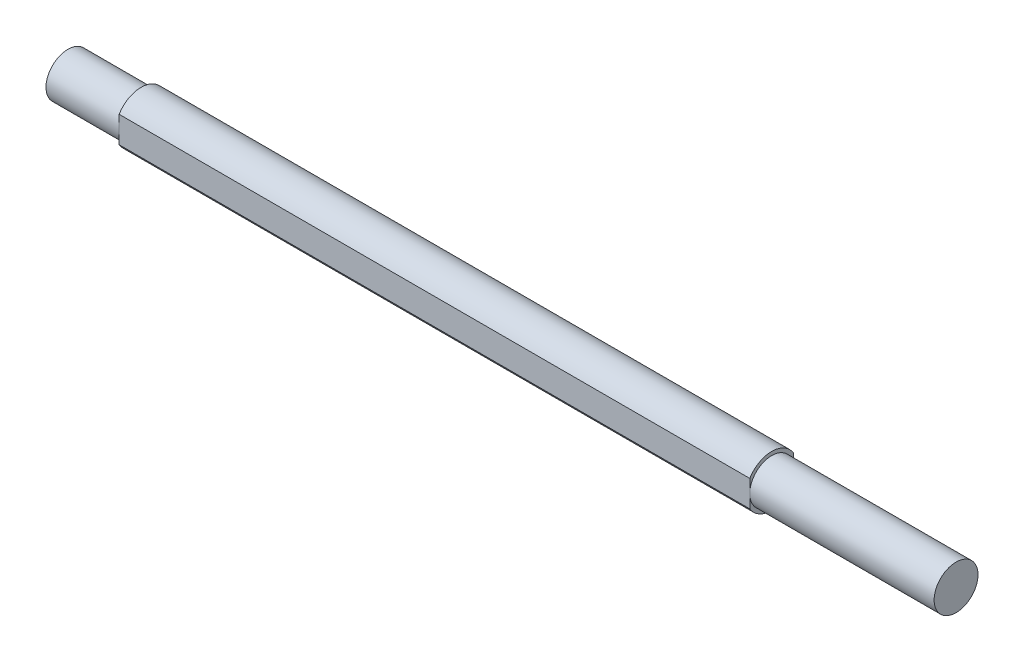
ISO-10303-21;
HEADER;
FILE_DESCRIPTION(('STEP AP214'),'2;1');
FILE_NAME('part.step','',(''),(''),'','','');
FILE_SCHEMA(('AUTOMOTIVE_DESIGN { 1 0 10303 214 1 1 1 1 }'));
ENDSEC;
DATA;
#1=APPLICATION_CONTEXT('core data for automotive mechanical design processes');
#2=APPLICATION_PROTOCOL_DEFINITION('international standard','automotive_design',2000,#1);
#3=PRODUCT_CONTEXT('',#1,'mechanical');
#4=PRODUCT('Part','Part','',(#3));
#5=PRODUCT_RELATED_PRODUCT_CATEGORY('part','',(#4));
#6=PRODUCT_DEFINITION_FORMATION('','',#4);
#7=PRODUCT_DEFINITION_CONTEXT('part definition',#1,'design');
#8=PRODUCT_DEFINITION('design','',#6,#7);
#9=PRODUCT_DEFINITION_SHAPE('','',#8);
#10=(LENGTH_UNIT() NAMED_UNIT(*) SI_UNIT(.MILLI.,.METRE.));
#11=(NAMED_UNIT(*) PLANE_ANGLE_UNIT() SI_UNIT($,.RADIAN.));
#12=(NAMED_UNIT(*) SI_UNIT($,.STERADIAN.) SOLID_ANGLE_UNIT());
#13=UNCERTAINTY_MEASURE_WITH_UNIT(LENGTH_MEASURE(1.E-05),#10,'distance_accuracy_value','');
#14=(GEOMETRIC_REPRESENTATION_CONTEXT(3) GLOBAL_UNCERTAINTY_ASSIGNED_CONTEXT((#13)) GLOBAL_UNIT_ASSIGNED_CONTEXT((#10,
#11,#12)) REPRESENTATION_CONTEXT('',''));
#15=CARTESIAN_POINT('',(0.,0.,0.));
#16=DIRECTION('',(0.,0.,1.));
#17=DIRECTION('',(1.,0.,0.));
#18=AXIS2_PLACEMENT_3D('',#15,#16,#17);
#19=CARTESIAN_POINT('',(177.5,17.5,0.));
#20=DIRECTION('',(-1.,0.,0.));
#21=DIRECTION('',(0.,-1.,0.));
#22=AXIS2_PLACEMENT_3D('',#19,#20,#21);
#23=PLANE('',#22);
#24=CARTESIAN_POINT('',(177.5,-3.68808087731798E-13,0.));
#25=DIRECTION('',(-1.,0.,0.));
#26=DIRECTION('',(0.,-1.,0.));
#27=AXIS2_PLACEMENT_3D('',#24,#25,#26);
#28=CIRCLE('',#27,17.5000000000003);
#29=CARTESIAN_POINT('',(177.5,-9.01387818866019,-15.0000000000003));
#30=VERTEX_POINT('',#29);
#31=CARTESIAN_POINT('',(177.5,-9.01387818866019,15.0000000000003));
#32=VERTEX_POINT('',#31);
#33=EDGE_CURVE('E177',#30,#32,#28,.T.);
#34=ORIENTED_EDGE('',*,*,#33,.F.);
#35=DIRECTION('',(0.,-1.,0.));
#36=VECTOR('',#35,1.);
#37=CARTESIAN_POINT('',(177.5,9.01387818866015,-15.0000000000003));
#38=LINE('',#37,#36);
#39=CARTESIAN_POINT('',(177.5,-3.6949610038306E-13,-15.0000000000003));
#40=VERTEX_POINT('',#39);
#41=EDGE_CURVE('E152',#40,#30,#38,.T.);
#42=ORIENTED_EDGE('',*,*,#41,.F.);
#43=CARTESIAN_POINT('',(177.5,-3.68808087731798E-13,0.));
#44=DIRECTION('',(-1.,0.,0.));
#45=DIRECTION('',(0.,-1.,0.));
#46=AXIS2_PLACEMENT_3D('',#43,#44,#45);
#47=CIRCLE('',#46,15.0000000000004);
#48=CARTESIAN_POINT('',(177.5,-3.6949610038306E-13,15.0000000000003));
#49=VERTEX_POINT('',#48);
#50=EDGE_CURVE('E185',#40,#49,#47,.T.);
#51=ORIENTED_EDGE('',*,*,#50,.T.);
#52=DIRECTION('',(0.,1.,0.));
#53=VECTOR('',#52,1.);
#54=CARTESIAN_POINT('',(177.5,9.01387818866015,15.0000000000003));
#55=LINE('',#54,#53);
#56=EDGE_CURVE('E165',#32,#49,#55,.T.);
#57=ORIENTED_EDGE('',*,*,#56,.F.);
#58=EDGE_LOOP('',(#34,#42,#51,#57));
#59=FACE_BOUND('',#58,.T.);
#60=ADVANCED_FACE('F34',(#59),#23,.F.);
#61=CARTESIAN_POINT('',(-303.5,-4.00105338657338E-13,0.));
#62=DIRECTION('',(-1.,0.,0.));
#63=DIRECTION('',(0.,-1.,0.));
#64=AXIS2_PLACEMENT_3D('',#61,#62,#63);
#65=CYLINDRICAL_SURFACE('',#64,17.5000000000004);
#66=CARTESIAN_POINT('',(177.5,9.01387818866015,15.0000000000003));
#67=VERTEX_POINT('',#66);
#68=CARTESIAN_POINT('',(177.5,9.01387818866015,-15.0000000000003));
#69=VERTEX_POINT('',#68);
#70=EDGE_CURVE('E180',#67,#69,#28,.T.);
#71=ORIENTED_EDGE('',*,*,#70,.T.);
#72=DIRECTION('',(-1.,0.,0.));
#73=VECTOR('',#72,1.);
#74=CARTESIAN_POINT('',(195.700274723202,9.01387818866015,-15.0000000000003));
#75=LINE('',#74,#73);
#76=CARTESIAN_POINT('',(-253.5,9.01387818866015,-15.0000000000003));
#77=VERTEX_POINT('',#76);
#78=EDGE_CURVE('E149',#69,#77,#75,.T.);
#79=ORIENTED_EDGE('',*,*,#78,.T.);
#80=CARTESIAN_POINT('',(-253.5,-3.96851986170275E-13,0.));
#81=DIRECTION('',(-1.,0.,0.));
#82=DIRECTION('',(0.,-1.,0.));
#83=AXIS2_PLACEMENT_3D('',#80,#81,#82);
#84=CIRCLE('',#83,17.5000000000004);
#85=CARTESIAN_POINT('',(-253.5,9.01387818865997,15.0000000000003));
#86=VERTEX_POINT('',#85);
#87=EDGE_CURVE('E176',#86,#77,#84,.T.);
#88=ORIENTED_EDGE('',*,*,#87,.F.);
#89=DIRECTION('',(-1.,0.,0.));
#90=VECTOR('',#89,1.);
#91=CARTESIAN_POINT('',(195.700274723202,9.01387818866015,15.0000000000003));
#92=LINE('',#91,#90);
#93=EDGE_CURVE('E159',#67,#86,#92,.T.);
#94=ORIENTED_EDGE('',*,*,#93,.F.);
#95=EDGE_LOOP('',(#71,#79,#88,#94));
#96=FACE_BOUND('',#95,.T.);
#97=ADVANCED_FACE('F235',(#96),#65,.T.);
#98=CARTESIAN_POINT('',(-253.5,15.0000000000001,0.));
#99=DIRECTION('',(1.,0.,0.));
#100=DIRECTION('',(0.,1.,0.));
#101=AXIS2_PLACEMENT_3D('',#98,#99,#100);
#102=PLANE('',#101);
#103=ORIENTED_EDGE('',*,*,#87,.T.);
#104=DIRECTION('',(0.,1.,0.));
#105=VECTOR('',#104,1.);
#106=CARTESIAN_POINT('',(-253.5,9.01387818866015,-15.0000000000003));
#107=LINE('',#106,#105);
#108=CARTESIAN_POINT('',(-253.5,-3.96851986170275E-13,-15.0000000000003));
#109=VERTEX_POINT('',#108);
#110=EDGE_CURVE('E148',#109,#77,#107,.T.);
#111=ORIENTED_EDGE('',*,*,#110,.F.);
#112=CARTESIAN_POINT('',(-253.5,-3.96851986170275E-13,0.));
#113=DIRECTION('',(-1.,0.,0.));
#114=DIRECTION('',(0.,-1.,0.));
#115=AXIS2_PLACEMENT_3D('',#112,#113,#114);
#116=CIRCLE('',#115,15.0000000000005);
#117=CARTESIAN_POINT('',(-253.5,-3.96851986170275E-13,15.0000000000003));
#118=VERTEX_POINT('',#117);
#119=EDGE_CURVE('E170',#118,#109,#116,.T.);
#120=ORIENTED_EDGE('',*,*,#119,.F.);
#121=DIRECTION('',(0.,-1.,0.));
#122=VECTOR('',#121,1.);
#123=CARTESIAN_POINT('',(-253.5,9.01387818866015,15.0000000000003));
#124=LINE('',#123,#122);
#125=EDGE_CURVE('E157',#86,#118,#124,.T.);
#126=ORIENTED_EDGE('',*,*,#125,.F.);
#127=EDGE_LOOP('',(#103,#111,#120,#126));
#128=FACE_BOUND('',#127,.T.);
#129=ADVANCED_FACE('F231',(#128),#102,.F.);
#130=CARTESIAN_POINT('',(303.5,15.0000000000001,0.));
#131=DIRECTION('',(-1.,0.,0.));
#132=DIRECTION('',(0.,-1.,0.));
#133=AXIS2_PLACEMENT_3D('',#130,#131,#132);
#134=PLANE('',#133);
#135=CARTESIAN_POINT('',(303.5,-3.60609639464401E-13,0.));
#136=DIRECTION('',(-1.,0.,0.));
#137=DIRECTION('',(0.,-1.,0.));
#138=AXIS2_PLACEMENT_3D('',#135,#136,#137);
#139=CIRCLE('',#138,15.0000000000005);
#140=CARTESIAN_POINT('',(303.5,-15.0000000000008,0.));
#141=VERTEX_POINT('',#140);
#142=EDGE_CURVE('E184',#141,#141,#139,.T.);
#143=ORIENTED_EDGE('',*,*,#142,.F.);
#144=EDGE_LOOP('',(#143));
#145=FACE_BOUND('',#144,.T.);
#146=ADVANCED_FACE('F36',(#145),#134,.F.);
#147=CARTESIAN_POINT('',(-303.5,-4.00105338657338E-13,0.));
#148=DIRECTION('',(-1.,0.,0.));
#149=DIRECTION('',(0.,-1.,0.));
#150=AXIS2_PLACEMENT_3D('',#147,#148,#149);
#151=CYLINDRICAL_SURFACE('',#150,15.0000000000004);
#152=DIRECTION('',(-1.,0.,0.));
#153=VECTOR('',#152,1.);
#154=CARTESIAN_POINT('',(-303.5,-14.4568322948018,4.00000000000006));
#155=LINE('',#154,#153);
#156=CARTESIAN_POINT('',(237.5,-14.4568322948018,4.00000000000001));
#157=VERTEX_POINT('',#156);
#158=CARTESIAN_POINT('',(297.5,-14.4568322948018,4.));
#159=VERTEX_POINT('',#158);
#160=EDGE_CURVE('E47',#157,#159,#155,.F.);
#161=ORIENTED_EDGE('',*,*,#160,.T.);
#162=CARTESIAN_POINT('',(297.5,-14.4568322948018,4.));
#163=CARTESIAN_POINT('',(297.610358243404,-14.4568189842475,4.00001309389174));
#164=CARTESIAN_POINT('',(297.720708521993,-14.4580956467725,3.99543311151603));
#165=CARTESIAN_POINT('',(297.940578653966,-14.4631301353525,3.97718874589725));
#166=CARTESIAN_POINT('',(298.05009865776,-14.4668875005967,3.96352604983924));
#167=CARTESIAN_POINT('',(298.267301653514,-14.4767740441066,3.92725695741262));
#168=CARTESIAN_POINT('',(298.374988087848,-14.4828981072588,3.90466984692446));
#169=CARTESIAN_POINT('',(298.587974860356,-14.4973231400475,3.85076543838184));
#170=CARTESIAN_POINT('',(298.693275156585,-14.5056241479182,3.81944798699437));
#171=CARTESIAN_POINT('',(299.004463418775,-14.5334412456835,3.71275643853687));
#172=CARTESIAN_POINT('',(299.205874933547,-14.555882959826,3.62460332607936));
#173=CARTESIAN_POINT('',(299.591020759626,-14.6060171290385,3.41695780475822));
#174=CARTESIAN_POINT('',(299.774749203972,-14.6337113178043,3.29745504324307));
#175=CARTESIAN_POINT('',(300.123970576928,-14.6920016406374,3.02730320878008));
#176=CARTESIAN_POINT('',(300.288961840966,-14.722648945245,2.87601544465616));
#177=CARTESIAN_POINT('',(300.591557566962,-14.7829523618636,2.54795832924026));
#178=CARTESIAN_POINT('',(300.729157582868,-14.8126083123125,2.37118484921246));
#179=CARTESIAN_POINT('',(300.975172130186,-14.8681604116929,1.99367199592154));
#180=CARTESIAN_POINT('',(301.083083965578,-14.8939887414065,1.79259414843393));
#181=CARTESIAN_POINT('',(301.263372888961,-14.9383834129144,1.37435575552788));
#182=CARTESIAN_POINT('',(301.335757644777,-14.9569513215526,1.15719869214845));
#183=CARTESIAN_POINT('',(301.441309825169,-14.984370921786,0.718234307369671));
#184=CARTESIAN_POINT('',(301.475337212894,-14.9934353394145,0.496647293428104));
#185=CARTESIAN_POINT('',(301.505914313223,-15.001570510364,0.050731991760574));
#186=CARTESIAN_POINT('',(301.502469484192,-15.0006427191934,-0.173595891963458));
#187=CARTESIAN_POINT('',(301.458804313632,-14.9890534931384,-0.61262950264217));
#188=CARTESIAN_POINT('',(301.419513872344,-14.9786381919451,-0.827435206418321));
#189=CARTESIAN_POINT('',(301.306774849137,-14.949534779592,-1.24728467665105));
#190=CARTESIAN_POINT('',(301.233324647849,-14.9308462762372,-1.45232797980576));
#191=CARTESIAN_POINT('',(301.053640033747,-14.8869312076953,-1.84920963545356));
#192=CARTESIAN_POINT('',(300.94708662777,-14.8616414267941,-2.04089626466618));
#193=CARTESIAN_POINT('',(300.704457231035,-14.8072486052905,-2.40398441957149));
#194=CARTESIAN_POINT('',(300.568376077817,-14.7781448982361,-2.57538239000351));
#195=CARTESIAN_POINT('',(300.265672028899,-14.7182294237981,-2.89854935036782));
#196=CARTESIAN_POINT('',(300.098241992106,-14.6873926412651,-3.0495572240081));
#197=CARTESIAN_POINT('',(299.739957159291,-14.628271620726,-3.32161448391784));
#198=CARTESIAN_POINT('',(299.549095903519,-14.5999880903717,-3.4426555807802));
#199=CARTESIAN_POINT('',(299.248646716635,-14.5618587427779,-3.59932937334134));
#200=CARTESIAN_POINT('',(299.145711084959,-14.5498268172629,-3.64754371945349));
#201=CARTESIAN_POINT('',(298.935953678728,-14.5275984074133,-3.73509417643329));
#202=CARTESIAN_POINT('',(298.829133487537,-14.5174011851065,-3.77443385857866));
#203=CARTESIAN_POINT('',(298.61248058078,-14.4991713081519,-3.84386783810503));
#204=CARTESIAN_POINT('',(298.502651121807,-14.491136408062,-3.87397173088606));
#205=CARTESIAN_POINT('',(298.280724778875,-14.4774747012199,-3.92471856960776));
#206=CARTESIAN_POINT('',(298.16862897718,-14.4718467722239,-3.94536592495321));
#207=CARTESIAN_POINT('',(297.963748975282,-14.4639761334317,-3.97411378733402));
#208=CARTESIAN_POINT('',(297.871203553833,-14.4613012625141,-3.98382319960776));
#209=CARTESIAN_POINT('',(297.68577464669,-14.4577275048604,-3.99676420153355));
#210=CARTESIAN_POINT('',(297.592891929568,-14.4568258092267,-4.00000603663184));
#211=CARTESIAN_POINT('',(297.5,-14.4568322948018,-4.));
#212=B_SPLINE_CURVE_WITH_KNOTS('',3,(#162,#163,#164,#165,#166,#167,#168,#169,#170,#171,#172,
#173,#174,#175,#176,#177,#178,#179,#180,#181,#182,#183,#184,#185,#186,#187,#188,#189,#190,#191,
#192,#193,#194,#195,#196,#197,#198,#199,#200,#201,#202,#203,#204,#205,#206,#207,#208,#209,#210,
#211),.UNSPECIFIED.,.F.,.F.,(4,2,2,2,2,2,2,2,2,2,2,2,2,2,2,2,2,2,2,2,2,2,2,2,4),(0.,
0.330958670878051,0.66185588076851,0.992041890688623,1.32223370010826,1.98190700187175,
2.64179842357632,3.31649637536153,3.99130375261123,4.67691814590527,5.36238449759352,
6.03215661862344,6.7018311790669,7.35461236515045,8.0074244999636,8.66673340793705,
9.32615767867958,10.0057598785669,10.6855498604333,11.0281077435251,11.3705275300853,
11.7125903499582,12.0544935096115,12.3335333037377,12.6121307120355),.UNSPECIFIED.);
#213=CARTESIAN_POINT('',(297.5,-14.4568322948018,-4.));
#214=VERTEX_POINT('',#213);
#215=EDGE_CURVE('E11',#159,#214,#212,.T.);
#216=ORIENTED_EDGE('',*,*,#215,.T.);
#217=DIRECTION('',(-1.,0.,0.));
#218=VECTOR('',#217,1.);
#219=CARTESIAN_POINT('',(-303.5,-14.4568322948018,-3.99999999999992));
#220=LINE('',#219,#218);
#221=CARTESIAN_POINT('',(237.5,-14.4568322948018,-3.99999999999992));
#222=VERTEX_POINT('',#221);
#223=EDGE_CURVE('E119',#214,#222,#220,.T.);
#224=ORIENTED_EDGE('',*,*,#223,.T.);
#225=CARTESIAN_POINT('',(237.5,-14.4568322948018,-3.99999999999999));
#226=CARTESIAN_POINT('',(237.389641756596,-14.4568189842475,-4.00001309389173));
#227=CARTESIAN_POINT('',(237.279291478007,-14.4580956467725,-3.99543311151602));
#228=CARTESIAN_POINT('',(237.059421346034,-14.4631301353525,-3.97718874589724));
#229=CARTESIAN_POINT('',(236.94990134224,-14.4668875005967,-3.96352604983923));
#230=CARTESIAN_POINT('',(236.732698346486,-14.4767740441067,-3.92725695741262));
#231=CARTESIAN_POINT('',(236.625011912152,-14.4828981072588,-3.90466984692445));
#232=CARTESIAN_POINT('',(236.412025139644,-14.4973231400475,-3.85076543838183));
#233=CARTESIAN_POINT('',(236.306724843415,-14.5056241479182,-3.81944798699436));
#234=CARTESIAN_POINT('',(235.995536581225,-14.5334412456835,-3.71275643853685));
#235=CARTESIAN_POINT('',(235.794125066453,-14.555882959826,-3.62460332607934));
#236=CARTESIAN_POINT('',(235.408979240374,-14.6060171290385,-3.41695780475818));
#237=CARTESIAN_POINT('',(235.225250796028,-14.6337113178043,-3.29745504324305));
#238=CARTESIAN_POINT('',(234.876029423072,-14.6920016406374,-3.02730320878009));
#239=CARTESIAN_POINT('',(234.711038159034,-14.722648945245,-2.87601544465618));
#240=CARTESIAN_POINT('',(234.408442433038,-14.7829523618636,-2.54795832924028));
#241=CARTESIAN_POINT('',(234.270842417132,-14.8126083123125,-2.37118484921248));
#242=CARTESIAN_POINT('',(234.024827869815,-14.8681604116929,-1.99367199592155));
#243=CARTESIAN_POINT('',(233.916916034422,-14.8939887414065,-1.79259414843395));
#244=CARTESIAN_POINT('',(233.736627111039,-14.9383834129144,-1.37435575552789));
#245=CARTESIAN_POINT('',(233.664242355223,-14.9569513215526,-1.15719869214844));
#246=CARTESIAN_POINT('',(233.558690174831,-14.984370921786,-0.718234307369647));
#247=CARTESIAN_POINT('',(233.524662787106,-14.9934353394145,-0.496647293428083));
#248=CARTESIAN_POINT('',(233.494085686777,-15.001570510364,-0.050731991760559));
#249=CARTESIAN_POINT('',(233.497530515807,-15.0006427191934,0.173595891963471));
#250=CARTESIAN_POINT('',(233.541195686368,-14.9890534931384,0.612629502642185));
#251=CARTESIAN_POINT('',(233.580486127656,-14.9786381919451,0.827435206418341));
#252=CARTESIAN_POINT('',(233.693225150863,-14.949534779592,1.24728467665107));
#253=CARTESIAN_POINT('',(233.766675352151,-14.9308462762372,1.45232797980577));
#254=CARTESIAN_POINT('',(233.946359966253,-14.8869312076953,1.84920963545357));
#255=CARTESIAN_POINT('',(234.05291337223,-14.8616414267941,2.04089626466619));
#256=CARTESIAN_POINT('',(234.295542768965,-14.8072486052905,2.40398441957151));
#257=CARTESIAN_POINT('',(234.431623922183,-14.7781448982361,2.57538239000353));
#258=CARTESIAN_POINT('',(234.734327971101,-14.7182294237981,2.89854935036783));
#259=CARTESIAN_POINT('',(234.901758007894,-14.6873926412652,3.0495572240081));
#260=CARTESIAN_POINT('',(235.260042840709,-14.628271620726,3.32161448391784));
#261=CARTESIAN_POINT('',(235.450904096481,-14.5999880903717,3.44265558078022));
#262=CARTESIAN_POINT('',(235.751353283365,-14.5618587427779,3.59932937334135));
#263=CARTESIAN_POINT('',(235.854288915041,-14.5498268172629,3.6475437194535));
#264=CARTESIAN_POINT('',(236.064046321271,-14.5275984074133,3.73509417643329));
#265=CARTESIAN_POINT('',(236.170866512463,-14.5174011851065,3.77443385857866));
#266=CARTESIAN_POINT('',(236.38751941922,-14.4991713081519,3.84386783810502));
#267=CARTESIAN_POINT('',(236.497348878193,-14.491136408062,3.87397173088605));
#268=CARTESIAN_POINT('',(236.719275221125,-14.4774747012199,3.92471856960776));
#269=CARTESIAN_POINT('',(236.83137102282,-14.4718467722239,3.94536592495321));
#270=CARTESIAN_POINT('',(237.036251024718,-14.4639761334317,3.97411378733404));
#271=CARTESIAN_POINT('',(237.128796446167,-14.4613012625141,3.98382319960777));
#272=CARTESIAN_POINT('',(237.31422535331,-14.4577275048604,3.99676420153356));
#273=CARTESIAN_POINT('',(237.407108070432,-14.4568258092267,4.00000603663184));
#274=CARTESIAN_POINT('',(237.5,-14.4568322948018,4.00000000000001));
#275=B_SPLINE_CURVE_WITH_KNOTS('',3,(#225,#226,#227,#228,#229,#230,#231,#232,#233,#234,#235,
#236,#237,#238,#239,#240,#241,#242,#243,#244,#245,#246,#247,#248,#249,#250,#251,#252,#253,#254,
#255,#256,#257,#258,#259,#260,#261,#262,#263,#264,#265,#266,#267,#268,#269,#270,#271,#272,#273,
#274),.UNSPECIFIED.,.F.,.F.,(4,2,2,2,2,2,2,2,2,2,2,2,2,2,2,2,2,2,2,2,2,2,2,2,4),(0.,
0.330958670878051,0.66185588076851,0.992041890688596,1.32223370010826,1.98190700187181,
2.64179842357632,3.31649637536148,3.99130375261119,4.67691814590524,5.36238449759353,
6.03215661862344,6.7018311790669,7.35461236515046,8.00742449996359,8.66673340793706,
9.32615767867958,10.005759878567,10.6855498604333,11.0281077435251,11.3705275300853,
11.7125903499582,12.0544935096114,12.3335333037377,12.6121307120356),.UNSPECIFIED.);
#276=EDGE_CURVE('E189',#222,#157,#275,.T.);
#277=ORIENTED_EDGE('',*,*,#276,.T.);
#278=EDGE_LOOP('',(#161,#216,#224,#277));
#279=FACE_BOUND('',#278,.T.);
#280=EDGE_CURVE('E181',#49,#40,#47,.T.);
#281=ORIENTED_EDGE('',*,*,#280,.F.);
#282=ORIENTED_EDGE('',*,*,#50,.F.);
#283=EDGE_LOOP('',(#281,#282));
#284=FACE_BOUND('',#283,.T.);
#285=ORIENTED_EDGE('',*,*,#142,.T.);
#286=EDGE_LOOP('',(#285));
#287=FACE_BOUND('',#286,.T.);
#288=ADVANCED_FACE('F196',(#279,#284,#287),#151,.T.);
#289=ORIENTED_EDGE('',*,*,#280,.T.);
#290=EDGE_CURVE('E154',#69,#40,#38,.T.);
#291=ORIENTED_EDGE('',*,*,#290,.F.);
#292=ORIENTED_EDGE('',*,*,#70,.F.);
#293=EDGE_CURVE('E163',#49,#67,#55,.T.);
#294=ORIENTED_EDGE('',*,*,#293,.F.);
#295=EDGE_LOOP('',(#289,#291,#292,#294));
#296=FACE_BOUND('',#295,.T.);
#297=ADVANCED_FACE('F233',(#296),#23,.F.);
#298=CARTESIAN_POINT('',(-253.5,-9.01387818866077,-15.0000000000003));
#299=VERTEX_POINT('',#298);
#300=CARTESIAN_POINT('',(-253.5,-9.01387818866019,15.0000000000003));
#301=VERTEX_POINT('',#300);
#302=EDGE_CURVE('E173',#299,#301,#84,.T.);
#303=ORIENTED_EDGE('',*,*,#302,.F.);
#304=DIRECTION('',(-1.,0.,0.));
#305=VECTOR('',#304,1.);
#306=CARTESIAN_POINT('',(195.700274723202,-9.01387818866019,-15.0000000000003));
#307=LINE('',#306,#305);
#308=EDGE_CURVE('E62',#30,#299,#307,.T.);
#309=ORIENTED_EDGE('',*,*,#308,.F.);
#310=ORIENTED_EDGE('',*,*,#33,.T.);
#311=DIRECTION('',(-1.,0.,0.));
#312=VECTOR('',#311,1.);
#313=CARTESIAN_POINT('',(195.700274723202,-9.01387818866019,15.0000000000003));
#314=LINE('',#313,#312);
#315=EDGE_CURVE('E160',#32,#301,#314,.T.);
#316=ORIENTED_EDGE('',*,*,#315,.T.);
#317=EDGE_LOOP('',(#303,#309,#310,#316));
#318=FACE_BOUND('',#317,.T.);
#319=ADVANCED_FACE('F229',(#318),#65,.T.);
#320=EDGE_CURVE('E169',#109,#118,#116,.T.);
#321=ORIENTED_EDGE('',*,*,#320,.F.);
#322=EDGE_CURVE('E146',#299,#109,#107,.T.);
#323=ORIENTED_EDGE('',*,*,#322,.F.);
#324=ORIENTED_EDGE('',*,*,#302,.T.);
#325=EDGE_CURVE('E142',#118,#301,#124,.T.);
#326=ORIENTED_EDGE('',*,*,#325,.F.);
#327=EDGE_LOOP('',(#321,#323,#324,#326));
#328=FACE_BOUND('',#327,.T.);
#329=ADVANCED_FACE('F225',(#328),#102,.F.);
#330=CARTESIAN_POINT('',(-303.5,-4.00105338657338E-13,0.));
#331=DIRECTION('',(-1.,0.,0.));
#332=DIRECTION('',(0.,-1.,0.));
#333=AXIS2_PLACEMENT_3D('',#330,#331,#332);
#334=CYLINDRICAL_SURFACE('',#333,15.0000000000005);
#335=CARTESIAN_POINT('',(-303.5,-4.00105338657338E-13,0.));
#336=DIRECTION('',(-1.,0.,0.));
#337=DIRECTION('',(0.,-1.,0.));
#338=AXIS2_PLACEMENT_3D('',#335,#336,#337);
#339=CIRCLE('',#338,15.0000000000005);
#340=CARTESIAN_POINT('',(-303.5,-15.0000000000009,0.));
#341=VERTEX_POINT('',#340);
#342=EDGE_CURVE('E156',#341,#341,#339,.T.);
#343=ORIENTED_EDGE('',*,*,#342,.F.);
#344=EDGE_LOOP('',(#343));
#345=FACE_BOUND('',#344,.T.);
#346=ORIENTED_EDGE('',*,*,#119,.T.);
#347=ORIENTED_EDGE('',*,*,#320,.T.);
#348=EDGE_LOOP('',(#346,#347));
#349=FACE_BOUND('',#348,.T.);
#350=ADVANCED_FACE('F221',(#345,#349),#334,.T.);
#351=CARTESIAN_POINT('',(-303.5,-4.00105338657338E-13,0.));
#352=DIRECTION('',(1.,0.,0.));
#353=DIRECTION('',(0.,1.,0.));
#354=AXIS2_PLACEMENT_3D('',#351,#352,#353);
#355=PLANE('',#354);
#356=ORIENTED_EDGE('',*,*,#342,.T.);
#357=EDGE_LOOP('',(#356));
#358=FACE_BOUND('',#357,.T.);
#359=ADVANCED_FACE('F217',(#358),#355,.F.);
#360=CARTESIAN_POINT('',(195.700274723202,9.01387818866015,15.0000000000003));
#361=DIRECTION('',(0.,0.,-1.));
#362=DIRECTION('',(-1.,0.,0.));
#363=AXIS2_PLACEMENT_3D('',#360,#361,#362);
#364=PLANE('',#363);
#365=ORIENTED_EDGE('',*,*,#56,.T.);
#366=ORIENTED_EDGE('',*,*,#293,.T.);
#367=ORIENTED_EDGE('',*,*,#93,.T.);
#368=ORIENTED_EDGE('',*,*,#125,.T.);
#369=ORIENTED_EDGE('',*,*,#325,.T.);
#370=ORIENTED_EDGE('',*,*,#315,.F.);
#371=EDGE_LOOP('',(#365,#366,#367,#368,#369,#370));
#372=FACE_BOUND('',#371,.T.);
#373=ADVANCED_FACE('F214',(#372),#364,.F.);
#374=CARTESIAN_POINT('',(195.700274723202,9.01387818866015,-15.0000000000003));
#375=DIRECTION('',(0.,0.,1.));
#376=DIRECTION('',(1.,0.,0.));
#377=AXIS2_PLACEMENT_3D('',#374,#375,#376);
#378=PLANE('',#377);
#379=ORIENTED_EDGE('',*,*,#290,.T.);
#380=ORIENTED_EDGE('',*,*,#41,.T.);
#381=ORIENTED_EDGE('',*,*,#308,.T.);
#382=ORIENTED_EDGE('',*,*,#322,.T.);
#383=ORIENTED_EDGE('',*,*,#110,.T.);
#384=ORIENTED_EDGE('',*,*,#78,.F.);
#385=EDGE_LOOP('',(#379,#380,#381,#382,#383,#384));
#386=FACE_BOUND('',#385,.T.);
#387=ADVANCED_FACE('F211',(#386),#378,.F.);
#388=CARTESIAN_POINT('',(297.5,-24.,0.));
#389=DIRECTION('',(0.,1.,0.));
#390=DIRECTION('',(0.,0.,1.));
#391=AXIS2_PLACEMENT_3D('',#388,#389,#390);
#392=CYLINDRICAL_SURFACE('',#391,4.);
#393=DIRECTION('',(0.,1.,0.));
#394=VECTOR('',#393,1.);
#395=CARTESIAN_POINT('',(297.5,-24.,4.));
#396=LINE('',#395,#394);
#397=CARTESIAN_POINT('',(297.5,0.,4.));
#398=VERTEX_POINT('',#397);
#399=EDGE_CURVE('E136',#159,#398,#396,.T.);
#400=ORIENTED_EDGE('',*,*,#399,.T.);
#401=CARTESIAN_POINT('',(297.5,0.,0.));
#402=DIRECTION('',(0.,1.,0.));
#403=DIRECTION('',(0.,0.,1.));
#404=AXIS2_PLACEMENT_3D('',#401,#402,#403);
#405=CIRCLE('',#404,4.);
#406=CARTESIAN_POINT('',(297.5,0.,-4.));
#407=VERTEX_POINT('',#406);
#408=EDGE_CURVE('E129',#398,#407,#405,.T.);
#409=ORIENTED_EDGE('',*,*,#408,.T.);
#410=DIRECTION('',(0.,1.,0.));
#411=VECTOR('',#410,1.);
#412=CARTESIAN_POINT('',(297.5,-24.,-4.));
#413=LINE('',#412,#411);
#414=EDGE_CURVE('E114',#214,#407,#413,.T.);
#415=ORIENTED_EDGE('',*,*,#414,.F.);
#416=ORIENTED_EDGE('',*,*,#215,.F.);
#417=EDGE_LOOP('',(#400,#409,#415,#416));
#418=FACE_BOUND('',#417,.T.);
#419=ADVANCED_FACE('F134',(#418),#392,.F.);
#420=CARTESIAN_POINT('',(297.5,-24.,4.));
#421=DIRECTION('',(0.,0.,1.));
#422=DIRECTION('',(1.,0.,0.));
#423=AXIS2_PLACEMENT_3D('',#420,#421,#422);
#424=PLANE('',#423);
#425=DIRECTION('',(0.,1.,0.));
#426=VECTOR('',#425,1.);
#427=CARTESIAN_POINT('',(237.5,-24.,4.00000000000001));
#428=LINE('',#427,#426);
#429=CARTESIAN_POINT('',(237.5,0.,4.00000000000001));
#430=VERTEX_POINT('',#429);
#431=EDGE_CURVE('E143',#157,#430,#428,.T.);
#432=ORIENTED_EDGE('',*,*,#431,.T.);
#433=DIRECTION('',(1.,0.,0.));
#434=VECTOR('',#433,1.);
#435=CARTESIAN_POINT('',(297.5,0.,4.));
#436=LINE('',#435,#434);
#437=EDGE_CURVE('E122',#430,#398,#436,.T.);
#438=ORIENTED_EDGE('',*,*,#437,.T.);
#439=ORIENTED_EDGE('',*,*,#399,.F.);
#440=ORIENTED_EDGE('',*,*,#160,.F.);
#441=EDGE_LOOP('',(#432,#438,#439,#440));
#442=FACE_BOUND('',#441,.T.);
#443=ADVANCED_FACE('F204',(#442),#424,.F.);
#444=CARTESIAN_POINT('',(237.5,-24.,0.));
#445=DIRECTION('',(0.,1.,0.));
#446=DIRECTION('',(0.,0.,1.));
#447=AXIS2_PLACEMENT_3D('',#444,#445,#446);
#448=CYLINDRICAL_SURFACE('',#447,4.);
#449=DIRECTION('',(0.,1.,0.));
#450=VECTOR('',#449,1.);
#451=CARTESIAN_POINT('',(237.5,-24.,-3.99999999999999));
#452=LINE('',#451,#450);
#453=CARTESIAN_POINT('',(237.5,0.,-3.99999999999999));
#454=VERTEX_POINT('',#453);
#455=EDGE_CURVE('E54',#222,#454,#452,.T.);
#456=ORIENTED_EDGE('',*,*,#455,.T.);
#457=CARTESIAN_POINT('',(237.5,0.,0.));
#458=DIRECTION('',(0.,1.,0.));
#459=DIRECTION('',(0.,0.,1.));
#460=AXIS2_PLACEMENT_3D('',#457,#458,#459);
#461=CIRCLE('',#460,4.);
#462=EDGE_CURVE('E132',#454,#430,#461,.T.);
#463=ORIENTED_EDGE('',*,*,#462,.T.);
#464=ORIENTED_EDGE('',*,*,#431,.F.);
#465=ORIENTED_EDGE('',*,*,#276,.F.);
#466=EDGE_LOOP('',(#456,#463,#464,#465));
#467=FACE_BOUND('',#466,.T.);
#468=ADVANCED_FACE('F199',(#467),#448,.F.);
#469=CARTESIAN_POINT('',(297.5,-24.,-4.));
#470=DIRECTION('',(0.,0.,-1.));
#471=DIRECTION('',(-1.,0.,0.));
#472=AXIS2_PLACEMENT_3D('',#469,#470,#471);
#473=PLANE('',#472);
#474=ORIENTED_EDGE('',*,*,#414,.T.);
#475=DIRECTION('',(-1.,0.,0.));
#476=VECTOR('',#475,1.);
#477=CARTESIAN_POINT('',(297.5,0.,-4.));
#478=LINE('',#477,#476);
#479=EDGE_CURVE('E117',#407,#454,#478,.T.);
#480=ORIENTED_EDGE('',*,*,#479,.T.);
#481=ORIENTED_EDGE('',*,*,#455,.F.);
#482=ORIENTED_EDGE('',*,*,#223,.F.);
#483=EDGE_LOOP('',(#474,#480,#481,#482));
#484=FACE_BOUND('',#483,.T.);
#485=ADVANCED_FACE('F116',(#484),#473,.F.);
#486=CARTESIAN_POINT('',(297.5,0.,0.));
#487=DIRECTION('',(0.,1.,0.));
#488=DIRECTION('',(0.,0.,1.));
#489=AXIS2_PLACEMENT_3D('',#486,#487,#488);
#490=PLANE('',#489);
#491=ORIENTED_EDGE('',*,*,#408,.F.);
#492=ORIENTED_EDGE('',*,*,#437,.F.);
#493=ORIENTED_EDGE('',*,*,#462,.F.);
#494=ORIENTED_EDGE('',*,*,#479,.F.);
#495=EDGE_LOOP('',(#491,#492,#493,#494));
#496=FACE_BOUND('',#495,.T.);
#497=ADVANCED_FACE('F127',(#496),#490,.F.);
#498=CLOSED_SHELL('',(#60,#97,#129,#146,#288,#297,#319,#329,#350,#359,#373,#387,#419,#443,#468,
#485,#497));
#499=MANIFOLD_SOLID_BREP('B2',#498);
#500=ADVANCED_BREP_SHAPE_REPRESENTATION('',(#18,#499),#14);
#501=SHAPE_DEFINITION_REPRESENTATION(#9,#500);
ENDSEC;
END-ISO-10303-21;
